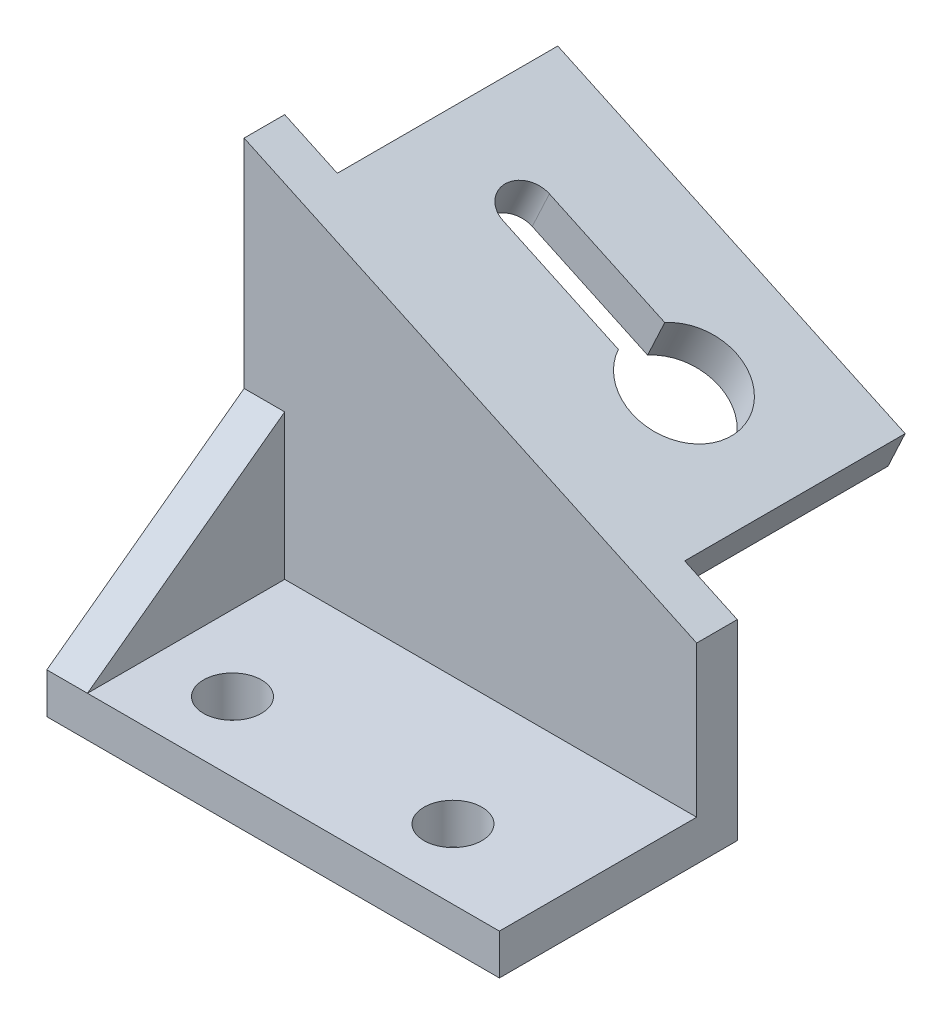
ISO-10303-21;
HEADER;
FILE_DESCRIPTION(('STEP AP214'),'2;1');
FILE_NAME('part.step','',(''),(''),'','','');
FILE_SCHEMA(('AUTOMOTIVE_DESIGN { 1 0 10303 214 1 1 1 1 }'));
ENDSEC;
DATA;
#1=APPLICATION_CONTEXT('core data for automotive mechanical design processes');
#2=APPLICATION_PROTOCOL_DEFINITION('international standard','automotive_design',2000,#1);
#3=PRODUCT_CONTEXT('',#1,'mechanical');
#4=PRODUCT('Part','Part','',(#3));
#5=PRODUCT_RELATED_PRODUCT_CATEGORY('part','',(#4));
#6=PRODUCT_DEFINITION_FORMATION('','',#4);
#7=PRODUCT_DEFINITION_CONTEXT('part definition',#1,'design');
#8=PRODUCT_DEFINITION('design','',#6,#7);
#9=PRODUCT_DEFINITION_SHAPE('','',#8);
#10=(LENGTH_UNIT() NAMED_UNIT(*) SI_UNIT(.MILLI.,.METRE.));
#11=(NAMED_UNIT(*) PLANE_ANGLE_UNIT() SI_UNIT($,.RADIAN.));
#12=(NAMED_UNIT(*) SI_UNIT($,.STERADIAN.) SOLID_ANGLE_UNIT());
#13=UNCERTAINTY_MEASURE_WITH_UNIT(LENGTH_MEASURE(1.E-05),#10,'distance_accuracy_value','');
#14=(GEOMETRIC_REPRESENTATION_CONTEXT(3) GLOBAL_UNCERTAINTY_ASSIGNED_CONTEXT((#13)) GLOBAL_UNIT_ASSIGNED_CONTEXT((#10,
#11,#12)) REPRESENTATION_CONTEXT('',''));
#15=CARTESIAN_POINT('',(0.,0.,0.));
#16=DIRECTION('',(0.,0.,1.));
#17=DIRECTION('',(1.,0.,0.));
#18=AXIS2_PLACEMENT_3D('',#15,#16,#17);
#19=CARTESIAN_POINT('',(78.,33.,-79.));
#20=DIRECTION('',(0.422618261740694,0.906307787036653,0.));
#21=DIRECTION('',(-0.906307787036653,0.422618261740694,0.));
#22=AXIS2_PLACEMENT_3D('',#19,#20,#21);
#23=PLANE('',#22);
#24=DIRECTION('',(0.906307787036652,-0.422618261740694,0.));
#25=VECTOR('',#24,1.);
#26=CARTESIAN_POINT('',(26.5710165336876,56.9817288414679,-41.));
#27=LINE('',#26,#25);
#28=CARTESIAN_POINT('',(68.9369221296335,37.226182617407,-41.));
#29=VERTEX_POINT('',#28);
#30=CARTESIAN_POINT('',(78.,33.,-41.));
#31=VERTEX_POINT('',#30);
#32=EDGE_CURVE('E178',#29,#31,#27,.T.);
#33=ORIENTED_EDGE('',*,*,#32,.F.);
#34=DIRECTION('',(0.,0.,1.));
#35=VECTOR('',#34,1.);
#36=CARTESIAN_POINT('',(68.9369221296335,37.226182617407,0.));
#37=LINE('',#36,#35);
#38=CARTESIAN_POINT('',(68.9369221296335,37.226182617407,-79.));
#39=VERTEX_POINT('',#38);
#40=EDGE_CURVE('E175',#39,#29,#37,.T.);
#41=ORIENTED_EDGE('',*,*,#40,.F.);
#42=DIRECTION('',(-0.906307787036653,0.422618261740694,0.));
#43=VECTOR('',#42,1.);
#44=CARTESIAN_POINT('',(78.,33.,-79.));
#45=LINE('',#44,#43);
#46=CARTESIAN_POINT('',(9.06307787036653,65.1458147186823,-79.));
#47=VERTEX_POINT('',#46);
#48=EDGE_CURVE('E244',#39,#47,#45,.T.);
#49=ORIENTED_EDGE('',*,*,#48,.T.);
#50=DIRECTION('',(0.,0.,1.));
#51=VECTOR('',#50,1.);
#52=CARTESIAN_POINT('',(9.06307787036657,65.1458147186824,0.));
#53=LINE('',#52,#51);
#54=CARTESIAN_POINT('',(9.06307787036656,65.1458147186824,-41.));
#55=VERTEX_POINT('',#54);
#56=EDGE_CURVE('E195',#47,#55,#53,.T.);
#57=ORIENTED_EDGE('',*,*,#56,.T.);
#58=DIRECTION('',(-0.906307787036652,0.422618261740694,0.));
#59=VECTOR('',#58,1.);
#60=CARTESIAN_POINT('',(26.5710165336877,56.9817288414679,-41.));
#61=LINE('',#60,#59);
#62=CARTESIAN_POINT('',(0.,69.3719973360893,-41.));
#63=VERTEX_POINT('',#62);
#64=EDGE_CURVE('E191',#55,#63,#61,.T.);
#65=ORIENTED_EDGE('',*,*,#64,.T.);
#66=DIRECTION('',(0.,0.,1.));
#67=VECTOR('',#66,1.);
#68=CARTESIAN_POINT('',(0.,69.3719973360893,-79.));
#69=LINE('',#68,#67);
#70=CARTESIAN_POINT('',(0.,69.3719973360893,-34.));
#71=VERTEX_POINT('',#70);
#72=EDGE_CURVE('E260',#63,#71,#69,.T.);
#73=ORIENTED_EDGE('',*,*,#72,.T.);
#74=DIRECTION('',(0.906307787036653,-0.422618261740694,0.));
#75=VECTOR('',#74,1.);
#76=CARTESIAN_POINT('',(78.,33.,-34.));
#77=LINE('',#76,#75);
#78=CARTESIAN_POINT('',(78.,33.,-34.));
#79=VERTEX_POINT('',#78);
#80=EDGE_CURVE('E234',#71,#79,#77,.T.);
#81=ORIENTED_EDGE('',*,*,#80,.T.);
#82=DIRECTION('',(0.,0.,1.));
#83=VECTOR('',#82,1.);
#84=CARTESIAN_POINT('',(78.,33.,-79.));
#85=LINE('',#84,#83);
#86=EDGE_CURVE('E264',#31,#79,#85,.T.);
#87=ORIENTED_EDGE('',*,*,#86,.F.);
#88=EDGE_LOOP('',(#33,#41,#49,#57,#65,#73,#81,#87));
#89=FACE_BOUND('',#88,.T.);
#90=CARTESIAN_POINT('',(23.6215327778009,58.3570957044417,-59.));
#91=DIRECTION('',(0.422618261740694,0.906307787036653,0.));
#92=DIRECTION('',(-0.906307787036653,0.422618261740694,0.));
#93=AXIS2_PLACEMENT_3D('',#90,#91,#92);
#94=CIRCLE('',#93,4.00000000000001);
#95=CARTESIAN_POINT('',(23.6215327778008,58.3570957044416,-63.));
#96=VERTEX_POINT('',#95);
#97=CARTESIAN_POINT('',(23.6215327778009,58.3570957044417,-55.));
#98=VERTEX_POINT('',#97);
#99=EDGE_CURVE('E345',#96,#98,#94,.T.);
#100=ORIENTED_EDGE('',*,*,#99,.F.);
#101=DIRECTION('',(0.906307787036652,-0.422618261740694,0.));
#102=VECTOR('',#101,1.);
#103=CARTESIAN_POINT('',(23.6215327778009,58.3570957044417,-63.));
#104=LINE('',#103,#102);
#105=CARTESIAN_POINT('',(43.5038794105209,49.0858052075122,-63.));
#106=VERTEX_POINT('',#105);
#107=EDGE_CURVE('E179',#96,#106,#104,.T.);
#108=ORIENTED_EDGE('',*,*,#107,.T.);
#109=CARTESIAN_POINT('',(50.8107663889004,45.6785478522209,-59.));
#110=DIRECTION('',(0.422618261740694,0.906307787036653,0.));
#111=DIRECTION('',(-0.906307787036653,0.422618261740694,0.));
#112=AXIS2_PLACEMENT_3D('',#109,#110,#111);
#113=CIRCLE('',#112,9.00000000000001);
#114=CARTESIAN_POINT('',(43.5038794105209,49.0858052075122,-55.));
#115=VERTEX_POINT('',#114);
#116=EDGE_CURVE('E185',#115,#106,#113,.T.);
#117=ORIENTED_EDGE('',*,*,#116,.F.);
#118=DIRECTION('',(0.906307787036652,-0.422618261740694,0.));
#119=VECTOR('',#118,1.);
#120=CARTESIAN_POINT('',(23.6215327778009,58.3570957044417,-55.));
#121=LINE('',#120,#119);
#122=EDGE_CURVE('E349',#98,#115,#121,.T.);
#123=ORIENTED_EDGE('',*,*,#122,.F.);
#124=EDGE_LOOP('',(#100,#108,#117,#123));
#125=FACE_BOUND('',#124,.T.);
#126=ADVANCED_FACE('F45',(#89,#125),#23,.T.);
#127=CARTESIAN_POINT('',(0.,0.,-79.));
#128=DIRECTION('',(-1.,0.,0.));
#129=DIRECTION('',(0.,0.,1.));
#130=AXIS2_PLACEMENT_3D('',#127,#128,#129);
#131=PLANE('',#130);
#132=DIRECTION('',(0.,-1.,0.));
#133=VECTOR('',#132,1.);
#134=CARTESIAN_POINT('',(0.,0.,-41.));
#135=LINE('',#134,#133);
#136=CARTESIAN_POINT('',(0.,0.,-41.));
#137=VERTEX_POINT('',#136);
#138=EDGE_CURVE('E54',#63,#137,#135,.T.);
#139=ORIENTED_EDGE('',*,*,#138,.T.);
#140=DIRECTION('',(0.,0.,1.));
#141=VECTOR('',#140,1.);
#142=CARTESIAN_POINT('',(0.,0.,-79.));
#143=LINE('',#142,#141);
#144=CARTESIAN_POINT('',(0.,0.,0.));
#145=VERTEX_POINT('',#144);
#146=EDGE_CURVE('E248',#137,#145,#143,.T.);
#147=ORIENTED_EDGE('',*,*,#146,.T.);
#148=DIRECTION('',(0.,-1.,0.));
#149=VECTOR('',#148,1.);
#150=CARTESIAN_POINT('',(0.,0.,0.));
#151=LINE('',#150,#149);
#152=CARTESIAN_POINT('',(0.,6.99999999999999,0.));
#153=VERTEX_POINT('',#152);
#154=EDGE_CURVE('E243',#153,#145,#151,.T.);
#155=ORIENTED_EDGE('',*,*,#154,.F.);
#156=DIRECTION('',(0.,0.592390450477518,-0.805651012649425));
#157=VECTOR('',#156,1.);
#158=CARTESIAN_POINT('',(0.,4.5435148792813,3.34081976417743));
#159=LINE('',#158,#157);
#160=CARTESIAN_POINT('',(0.,32.,-34.));
#161=VERTEX_POINT('',#160);
#162=EDGE_CURVE('E207',#153,#161,#159,.T.);
#163=ORIENTED_EDGE('',*,*,#162,.T.);
#164=DIRECTION('',(0.,-1.,0.));
#165=VECTOR('',#164,1.);
#166=CARTESIAN_POINT('',(0.,0.,-34.));
#167=LINE('',#166,#165);
#168=EDGE_CURVE('E204',#71,#161,#167,.T.);
#169=ORIENTED_EDGE('',*,*,#168,.F.);
#170=ORIENTED_EDGE('',*,*,#72,.F.);
#171=EDGE_LOOP('',(#139,#147,#155,#163,#169,#170));
#172=FACE_BOUND('',#171,.T.);
#173=ADVANCED_FACE('F47',(#172),#131,.T.);
#174=CARTESIAN_POINT('',(0.,0.,-79.));
#175=DIRECTION('',(0.,-1.,0.));
#176=DIRECTION('',(0.,0.,-1.));
#177=AXIS2_PLACEMENT_3D('',#174,#175,#176);
#178=PLANE('',#177);
#179=CARTESIAN_POINT('',(20.,0.,-12.));
#180=DIRECTION('',(0.,1.,0.));
#181=DIRECTION('',(0.,0.,1.));
#182=AXIS2_PLACEMENT_3D('',#179,#180,#181);
#183=CIRCLE('',#182,5.);
#184=CARTESIAN_POINT('',(20.,0.,-7.));
#185=VERTEX_POINT('',#184);
#186=EDGE_CURVE('E171',#185,#185,#183,.T.);
#187=ORIENTED_EDGE('',*,*,#186,.T.);
#188=EDGE_LOOP('',(#187));
#189=FACE_BOUND('',#188,.T.);
#190=CARTESIAN_POINT('',(58.,0.,-12.));
#191=DIRECTION('',(0.,1.,0.));
#192=DIRECTION('',(0.,0.,1.));
#193=AXIS2_PLACEMENT_3D('',#190,#191,#192);
#194=CIRCLE('',#193,5.);
#195=CARTESIAN_POINT('',(58.,0.,-7.));
#196=VERTEX_POINT('',#195);
#197=EDGE_CURVE('E378',#196,#196,#194,.T.);
#198=ORIENTED_EDGE('',*,*,#197,.T.);
#199=EDGE_LOOP('',(#198));
#200=FACE_BOUND('',#199,.T.);
#201=ORIENTED_EDGE('',*,*,#146,.F.);
#202=DIRECTION('',(-1.,0.,0.));
#203=VECTOR('',#202,1.);
#204=CARTESIAN_POINT('',(0.,0.,-41.));
#205=LINE('',#204,#203);
#206=CARTESIAN_POINT('',(78.,0.,-41.));
#207=VERTEX_POINT('',#206);
#208=EDGE_CURVE('E281',#207,#137,#205,.T.);
#209=ORIENTED_EDGE('',*,*,#208,.F.);
#210=DIRECTION('',(0.,0.,1.));
#211=VECTOR('',#210,1.);
#212=CARTESIAN_POINT('',(78.,0.,-79.));
#213=LINE('',#212,#211);
#214=CARTESIAN_POINT('',(78.,0.,0.));
#215=VERTEX_POINT('',#214);
#216=EDGE_CURVE('E267',#207,#215,#213,.T.);
#217=ORIENTED_EDGE('',*,*,#216,.T.);
#218=DIRECTION('',(1.,0.,0.));
#219=VECTOR('',#218,1.);
#220=CARTESIAN_POINT('',(0.,0.,0.));
#221=LINE('',#220,#219);
#222=EDGE_CURVE('E253',#145,#215,#221,.T.);
#223=ORIENTED_EDGE('',*,*,#222,.F.);
#224=EDGE_LOOP('',(#201,#209,#217,#223));
#225=FACE_BOUND('',#224,.T.);
#226=ADVANCED_FACE('F295',(#189,#200,#225),#178,.T.);
#227=CARTESIAN_POINT('',(0.,0.,-79.));
#228=DIRECTION('',(0.,0.,-1.));
#229=DIRECTION('',(-1.,0.,0.));
#230=AXIS2_PLACEMENT_3D('',#227,#228,#229);
#231=PLANE('',#230);
#232=DIRECTION('',(0.906307787036652,-0.422618261740694,0.));
#233=VECTOR('',#232,1.);
#234=CARTESIAN_POINT('',(-2.95832783218489,63.0278428268328,-79.));
#235=LINE('',#234,#233);
#236=CARTESIAN_POINT('',(6.1047500381817,58.8016602094259,-79.));
#237=VERTEX_POINT('',#236);
#238=CARTESIAN_POINT('',(65.9785942974487,30.8820281081505,-79.));
#239=VERTEX_POINT('',#238);
#240=EDGE_CURVE('E61',#237,#239,#235,.T.);
#241=ORIENTED_EDGE('',*,*,#240,.F.);
#242=DIRECTION('',(0.422618261740694,0.906307787036653,0.));
#243=VECTOR('',#242,1.);
#244=CARTESIAN_POINT('',(-17.5079386633211,8.16408587721448,-79.));
#245=LINE('',#244,#243);
#246=EDGE_CURVE('E275',#237,#47,#245,.T.);
#247=ORIENTED_EDGE('',*,*,#246,.T.);
#248=ORIENTED_EDGE('',*,*,#48,.F.);
#249=DIRECTION('',(0.422618261740694,0.906307787036653,0.));
#250=VECTOR('',#249,1.);
#251=CARTESIAN_POINT('',(42.3659055959459,-19.755546224061,-79.));
#252=LINE('',#251,#250);
#253=EDGE_CURVE('E278',#239,#39,#252,.T.);
#254=ORIENTED_EDGE('',*,*,#253,.F.);
#255=EDGE_LOOP('',(#241,#247,#248,#254));
#256=FACE_BOUND('',#255,.T.);
#257=ADVANCED_FACE('F426',(#256),#231,.T.);
#258=CARTESIAN_POINT('',(78.,0.,-79.));
#259=DIRECTION('',(1.,0.,0.));
#260=DIRECTION('',(0.,0.,-1.));
#261=AXIS2_PLACEMENT_3D('',#258,#259,#260);
#262=PLANE('',#261);
#263=DIRECTION('',(0.,-1.,0.));
#264=VECTOR('',#263,1.);
#265=CARTESIAN_POINT('',(78.,0.,-41.));
#266=LINE('',#265,#264);
#267=EDGE_CURVE('E201',#31,#207,#266,.T.);
#268=ORIENTED_EDGE('',*,*,#267,.F.);
#269=ORIENTED_EDGE('',*,*,#86,.T.);
#270=DIRECTION('',(0.,-1.,0.));
#271=VECTOR('',#270,1.);
#272=CARTESIAN_POINT('',(78.,0.,-34.));
#273=LINE('',#272,#271);
#274=CARTESIAN_POINT('',(78.,7.,-34.));
#275=VERTEX_POINT('',#274);
#276=EDGE_CURVE('E216',#79,#275,#273,.T.);
#277=ORIENTED_EDGE('',*,*,#276,.T.);
#278=DIRECTION('',(0.,0.,-1.));
#279=VECTOR('',#278,1.);
#280=CARTESIAN_POINT('',(78.,7.,0.));
#281=LINE('',#280,#279);
#282=CARTESIAN_POINT('',(78.,6.99999999999999,0.));
#283=VERTEX_POINT('',#282);
#284=EDGE_CURVE('E219',#283,#275,#281,.T.);
#285=ORIENTED_EDGE('',*,*,#284,.F.);
#286=DIRECTION('',(0.,1.,0.));
#287=VECTOR('',#286,1.);
#288=CARTESIAN_POINT('',(78.,0.,0.));
#289=LINE('',#288,#287);
#290=EDGE_CURVE('E249',#215,#283,#289,.T.);
#291=ORIENTED_EDGE('',*,*,#290,.F.);
#292=ORIENTED_EDGE('',*,*,#216,.F.);
#293=EDGE_LOOP('',(#268,#269,#277,#285,#291,#292));
#294=FACE_BOUND('',#293,.T.);
#295=ADVANCED_FACE('F424',(#294),#262,.T.);
#296=CARTESIAN_POINT('',(0.,0.,0.));
#297=DIRECTION('',(0.,0.,-1.));
#298=DIRECTION('',(-1.,0.,0.));
#299=AXIS2_PLACEMENT_3D('',#296,#297,#298);
#300=PLANE('',#299);
#301=DIRECTION('',(1.,0.,0.));
#302=VECTOR('',#301,1.);
#303=CARTESIAN_POINT('',(-71.0370751910094,6.99999999999999,0.));
#304=LINE('',#303,#302);
#305=CARTESIAN_POINT('',(7.00000000000001,6.99999999999999,0.));
#306=VERTEX_POINT('',#305);
#307=EDGE_CURVE('E224',#306,#283,#304,.T.);
#308=ORIENTED_EDGE('',*,*,#307,.F.);
#309=DIRECTION('',(1.,0.,0.));
#310=VECTOR('',#309,1.);
#311=CARTESIAN_POINT('',(0.,6.99999999999999,0.));
#312=LINE('',#311,#310);
#313=EDGE_CURVE('E211',#153,#306,#312,.T.);
#314=ORIENTED_EDGE('',*,*,#313,.F.);
#315=ORIENTED_EDGE('',*,*,#154,.T.);
#316=ORIENTED_EDGE('',*,*,#222,.T.);
#317=ORIENTED_EDGE('',*,*,#290,.T.);
#318=EDGE_LOOP('',(#308,#314,#315,#316,#317));
#319=FACE_BOUND('',#318,.T.);
#320=ADVANCED_FACE('F299',(#319),#300,.F.);
#321=CARTESIAN_POINT('',(-71.0370751910094,0.,-34.));
#322=DIRECTION('',(0.,0.,1.));
#323=DIRECTION('',(0.,-1.,0.));
#324=AXIS2_PLACEMENT_3D('',#321,#322,#323);
#325=PLANE('',#324);
#326=DIRECTION('',(1.,0.,0.));
#327=VECTOR('',#326,1.);
#328=CARTESIAN_POINT('',(-71.0370751910094,7.,-34.));
#329=LINE('',#328,#327);
#330=CARTESIAN_POINT('',(7.00000000000001,7.,-34.));
#331=VERTEX_POINT('',#330);
#332=EDGE_CURVE('E231',#331,#275,#329,.T.);
#333=ORIENTED_EDGE('',*,*,#332,.T.);
#334=ORIENTED_EDGE('',*,*,#276,.F.);
#335=ORIENTED_EDGE('',*,*,#80,.F.);
#336=ORIENTED_EDGE('',*,*,#168,.T.);
#337=DIRECTION('',(1.,0.,0.));
#338=VECTOR('',#337,1.);
#339=CARTESIAN_POINT('',(0.,32.,-34.));
#340=LINE('',#339,#338);
#341=CARTESIAN_POINT('',(7.,32.,-34.));
#342=VERTEX_POINT('',#341);
#343=EDGE_CURVE('E212',#161,#342,#340,.T.);
#344=ORIENTED_EDGE('',*,*,#343,.T.);
#345=DIRECTION('',(0.,-1.,0.));
#346=VECTOR('',#345,1.);
#347=CARTESIAN_POINT('',(7.00000000000001,0.,-34.));
#348=LINE('',#347,#346);
#349=EDGE_CURVE('E223',#342,#331,#348,.T.);
#350=ORIENTED_EDGE('',*,*,#349,.T.);
#351=EDGE_LOOP('',(#333,#334,#335,#336,#344,#350));
#352=FACE_BOUND('',#351,.T.);
#353=ADVANCED_FACE('F306',(#352),#325,.T.);
#354=CARTESIAN_POINT('',(-71.0370751910094,7.,0.));
#355=DIRECTION('',(0.,-1.,0.));
#356=DIRECTION('',(0.,0.,-1.));
#357=AXIS2_PLACEMENT_3D('',#354,#355,#356);
#358=PLANE('',#357);
#359=CARTESIAN_POINT('',(20.,7.,-12.));
#360=DIRECTION('',(0.,1.,0.));
#361=DIRECTION('',(0.,0.,1.));
#362=AXIS2_PLACEMENT_3D('',#359,#360,#361);
#363=CIRCLE('',#362,5.);
#364=CARTESIAN_POINT('',(20.,7.,-7.));
#365=VERTEX_POINT('',#364);
#366=EDGE_CURVE('E386',#365,#365,#363,.T.);
#367=ORIENTED_EDGE('',*,*,#366,.F.);
#368=EDGE_LOOP('',(#367));
#369=FACE_BOUND('',#368,.T.);
#370=CARTESIAN_POINT('',(58.,7.,-12.));
#371=DIRECTION('',(0.,1.,0.));
#372=DIRECTION('',(0.,0.,1.));
#373=AXIS2_PLACEMENT_3D('',#370,#371,#372);
#374=CIRCLE('',#373,5.);
#375=CARTESIAN_POINT('',(58.,7.,-7.));
#376=VERTEX_POINT('',#375);
#377=EDGE_CURVE('E382',#376,#376,#374,.T.);
#378=ORIENTED_EDGE('',*,*,#377,.F.);
#379=EDGE_LOOP('',(#378));
#380=FACE_BOUND('',#379,.T.);
#381=ORIENTED_EDGE('',*,*,#307,.T.);
#382=ORIENTED_EDGE('',*,*,#284,.T.);
#383=ORIENTED_EDGE('',*,*,#332,.F.);
#384=DIRECTION('',(0.,0.,-1.));
#385=VECTOR('',#384,1.);
#386=CARTESIAN_POINT('',(7.00000000000001,7.,0.));
#387=LINE('',#386,#385);
#388=EDGE_CURVE('E227',#306,#331,#387,.T.);
#389=ORIENTED_EDGE('',*,*,#388,.F.);
#390=EDGE_LOOP('',(#381,#382,#383,#389));
#391=FACE_BOUND('',#390,.T.);
#392=ADVANCED_FACE('F313',(#369,#380,#391),#358,.F.);
#393=CARTESIAN_POINT('',(7.,0.,-79.));
#394=DIRECTION('',(-1.,0.,0.));
#395=DIRECTION('',(0.,0.,1.));
#396=AXIS2_PLACEMENT_3D('',#393,#394,#395);
#397=PLANE('',#396);
#398=ORIENTED_EDGE('',*,*,#349,.F.);
#399=DIRECTION('',(0.,-0.592390450477518,0.805651012649425));
#400=VECTOR('',#399,1.);
#401=CARTESIAN_POINT('',(7.,42.2470522178551,-47.935991016283));
#402=LINE('',#401,#400);
#403=EDGE_CURVE('E263',#342,#306,#402,.T.);
#404=ORIENTED_EDGE('',*,*,#403,.T.);
#405=ORIENTED_EDGE('',*,*,#388,.T.);
#406=EDGE_LOOP('',(#398,#404,#405));
#407=FACE_BOUND('',#406,.T.);
#408=ADVANCED_FACE('F309',(#407),#397,.F.);
#409=CARTESIAN_POINT('',(0.,4.5435148792813,3.34081976417743));
#410=DIRECTION('',(0.,-0.805651012649425,-0.592390450477518));
#411=DIRECTION('',(0.,0.592390450477518,-0.805651012649425));
#412=AXIS2_PLACEMENT_3D('',#409,#410,#411);
#413=PLANE('',#412);
#414=ORIENTED_EDGE('',*,*,#343,.F.);
#415=ORIENTED_EDGE('',*,*,#162,.F.);
#416=ORIENTED_EDGE('',*,*,#313,.T.);
#417=ORIENTED_EDGE('',*,*,#403,.F.);
#418=EDGE_LOOP('',(#414,#415,#416,#417));
#419=FACE_BOUND('',#418,.T.);
#420=ADVANCED_FACE('F303',(#419),#413,.F.);
#421=CARTESIAN_POINT('',(-17.5079386633211,8.16408587721445,0.));
#422=DIRECTION('',(-0.906307787036653,0.422618261740694,0.));
#423=DIRECTION('',(-0.422618261740694,-0.906307787036653,0.));
#424=AXIS2_PLACEMENT_3D('',#421,#422,#423);
#425=PLANE('',#424);
#426=DIRECTION('',(0.,0.,-1.));
#427=VECTOR('',#426,1.);
#428=CARTESIAN_POINT('',(6.10475003818171,58.8016602094258,0.));
#429=LINE('',#428,#427);
#430=CARTESIAN_POINT('',(6.10475003818169,58.8016602094258,-41.));
#431=VERTEX_POINT('',#430);
#432=EDGE_CURVE('E325',#431,#237,#429,.T.);
#433=ORIENTED_EDGE('',*,*,#432,.F.);
#434=DIRECTION('',(0.422618261740694,0.906307787036653,0.));
#435=VECTOR('',#434,1.);
#436=CARTESIAN_POINT('',(-17.5079386633211,8.16408587721445,-41.));
#437=LINE('',#436,#435);
#438=EDGE_CURVE('E161',#431,#55,#437,.T.);
#439=ORIENTED_EDGE('',*,*,#438,.T.);
#440=ORIENTED_EDGE('',*,*,#56,.F.);
#441=ORIENTED_EDGE('',*,*,#246,.F.);
#442=EDGE_LOOP('',(#433,#439,#440,#441));
#443=FACE_BOUND('',#442,.T.);
#444=ADVANCED_FACE('F324',(#443),#425,.T.);
#445=CARTESIAN_POINT('',(0.,0.,-41.));
#446=DIRECTION('',(0.,0.,1.));
#447=DIRECTION('',(1.,0.,0.));
#448=AXIS2_PLACEMENT_3D('',#445,#446,#447);
#449=PLANE('',#448);
#450=ORIENTED_EDGE('',*,*,#267,.T.);
#451=ORIENTED_EDGE('',*,*,#208,.T.);
#452=ORIENTED_EDGE('',*,*,#138,.F.);
#453=ORIENTED_EDGE('',*,*,#64,.F.);
#454=ORIENTED_EDGE('',*,*,#438,.F.);
#455=DIRECTION('',(0.906307787036652,-0.422618261740694,0.));
#456=VECTOR('',#455,1.);
#457=CARTESIAN_POINT('',(-2.95832783218491,63.0278428268328,-41.));
#458=LINE('',#457,#456);
#459=CARTESIAN_POINT('',(65.9785942974486,30.8820281081504,-41.));
#460=VERTEX_POINT('',#459);
#461=EDGE_CURVE('E155',#431,#460,#458,.T.);
#462=ORIENTED_EDGE('',*,*,#461,.T.);
#463=DIRECTION('',(0.422618261740694,0.906307787036653,0.));
#464=VECTOR('',#463,1.);
#465=CARTESIAN_POINT('',(42.3659055959458,-19.755546224061,-41.));
#466=LINE('',#465,#464);
#467=EDGE_CURVE('E158',#460,#29,#466,.T.);
#468=ORIENTED_EDGE('',*,*,#467,.T.);
#469=ORIENTED_EDGE('',*,*,#32,.T.);
#470=EDGE_LOOP('',(#450,#451,#452,#453,#454,#462,#468,#469));
#471=FACE_BOUND('',#470,.T.);
#472=ADVANCED_FACE('F156',(#471),#449,.F.);
#473=CARTESIAN_POINT('',(42.3659055959458,-19.755546224061,0.));
#474=DIRECTION('',(-0.906307787036653,0.422618261740694,0.));
#475=DIRECTION('',(-0.422618261740694,-0.906307787036653,0.));
#476=AXIS2_PLACEMENT_3D('',#473,#474,#475);
#477=PLANE('',#476);
#478=ORIENTED_EDGE('',*,*,#467,.F.);
#479=DIRECTION('',(0.,0.,1.));
#480=VECTOR('',#479,1.);
#481=CARTESIAN_POINT('',(65.9785942974486,30.8820281081504,-41.));
#482=LINE('',#481,#480);
#483=EDGE_CURVE('E166',#239,#460,#482,.T.);
#484=ORIENTED_EDGE('',*,*,#483,.F.);
#485=ORIENTED_EDGE('',*,*,#253,.T.);
#486=ORIENTED_EDGE('',*,*,#40,.T.);
#487=EDGE_LOOP('',(#478,#484,#485,#486));
#488=FACE_BOUND('',#487,.T.);
#489=ADVANCED_FACE('F173',(#488),#477,.F.);
#490=CARTESIAN_POINT('',(-2.94948375588678,1.37536686297372,-63.));
#491=DIRECTION('',(0.,0.,1.));
#492=DIRECTION('',(1.,0.,0.));
#493=AXIS2_PLACEMENT_3D('',#490,#491,#492);
#494=PLANE('',#493);
#495=DIRECTION('',(-0.906307787036653,0.422618261740694,0.));
#496=VECTOR('',#495,1.);
#497=CARTESIAN_POINT('',(20.663204945616,52.0129411951851,-63.));
#498=LINE('',#497,#496);
#499=CARTESIAN_POINT('',(40.545551578336,42.7416506982557,-63.));
#500=VERTEX_POINT('',#499);
#501=CARTESIAN_POINT('',(20.663204945616,52.0129411951851,-63.));
#502=VERTEX_POINT('',#501);
#503=EDGE_CURVE('E69',#500,#502,#498,.T.);
#504=ORIENTED_EDGE('',*,*,#503,.F.);
#505=DIRECTION('',(0.422618261740694,0.906307787036653,0.));
#506=VECTOR('',#505,1.);
#507=CARTESIAN_POINT('',(16.9328628768332,-7.89592363395571,-63.));
#508=LINE('',#507,#506);
#509=EDGE_CURVE('E327',#500,#106,#508,.T.);
#510=ORIENTED_EDGE('',*,*,#509,.T.);
#511=ORIENTED_EDGE('',*,*,#107,.F.);
#512=DIRECTION('',(0.422618261740694,0.906307787036653,0.));
#513=VECTOR('',#512,1.);
#514=CARTESIAN_POINT('',(-2.94948375588678,1.37536686297372,-63.));
#515=LINE('',#514,#513);
#516=EDGE_CURVE('E342',#502,#96,#515,.T.);
#517=ORIENTED_EDGE('',*,*,#516,.F.);
#518=EDGE_LOOP('',(#504,#510,#511,#517));
#519=FACE_BOUND('',#518,.T.);
#520=ADVANCED_FACE('F365',(#519),#494,.T.);
#521=CARTESIAN_POINT('',(24.2397498552128,-11.3031809892471,-59.));
#522=DIRECTION('',(0.422618261740694,0.906307787036653,0.));
#523=DIRECTION('',(-0.906307787036653,0.422618261740694,0.));
#524=AXIS2_PLACEMENT_3D('',#521,#522,#523);
#525=CYLINDRICAL_SURFACE('',#524,9.00000000000001);
#526=ORIENTED_EDGE('',*,*,#509,.F.);
#527=CARTESIAN_POINT('',(47.8524385567156,39.3343933429643,-59.));
#528=DIRECTION('',(0.422618261740694,0.906307787036652,0.));
#529=DIRECTION('',(-0.906307787036653,0.422618261740694,0.));
#530=AXIS2_PLACEMENT_3D('',#527,#528,#529);
#531=CIRCLE('',#530,9.00000000000001);
#532=CARTESIAN_POINT('',(40.545551578336,42.7416506982557,-55.));
#533=VERTEX_POINT('',#532);
#534=EDGE_CURVE('E333',#500,#533,#531,.F.);
#535=ORIENTED_EDGE('',*,*,#534,.T.);
#536=DIRECTION('',(0.422618261740694,0.906307787036653,0.));
#537=VECTOR('',#536,1.);
#538=CARTESIAN_POINT('',(16.9328628768332,-7.89592363395571,-55.));
#539=LINE('',#538,#537);
#540=EDGE_CURVE('E331',#533,#115,#539,.T.);
#541=ORIENTED_EDGE('',*,*,#540,.T.);
#542=ORIENTED_EDGE('',*,*,#116,.T.);
#543=EDGE_LOOP('',(#526,#535,#541,#542));
#544=FACE_BOUND('',#543,.T.);
#545=ADVANCED_FACE('F357',(#544),#525,.F.);
#546=CARTESIAN_POINT('',(-2.94948375588678,1.37536686297372,-55.));
#547=DIRECTION('',(0.,0.,1.));
#548=DIRECTION('',(1.,0.,0.));
#549=AXIS2_PLACEMENT_3D('',#546,#547,#548);
#550=PLANE('',#549);
#551=ORIENTED_EDGE('',*,*,#540,.F.);
#552=DIRECTION('',(-0.906307787036653,0.422618261740694,0.));
#553=VECTOR('',#552,1.);
#554=CARTESIAN_POINT('',(20.663204945616,52.0129411951851,-55.));
#555=LINE('',#554,#553);
#556=CARTESIAN_POINT('',(20.663204945616,52.0129411951851,-55.));
#557=VERTEX_POINT('',#556);
#558=EDGE_CURVE('E164',#533,#557,#555,.T.);
#559=ORIENTED_EDGE('',*,*,#558,.T.);
#560=DIRECTION('',(0.422618261740694,0.906307787036653,0.));
#561=VECTOR('',#560,1.);
#562=CARTESIAN_POINT('',(-2.94948375588678,1.37536686297372,-55.));
#563=LINE('',#562,#561);
#564=EDGE_CURVE('E339',#557,#98,#563,.T.);
#565=ORIENTED_EDGE('',*,*,#564,.T.);
#566=ORIENTED_EDGE('',*,*,#122,.T.);
#567=EDGE_LOOP('',(#551,#559,#565,#566));
#568=FACE_BOUND('',#567,.T.);
#569=ADVANCED_FACE('F371',(#568),#550,.F.);
#570=CARTESIAN_POINT('',(-2.94948375588678,1.37536686297372,-59.));
#571=DIRECTION('',(0.422618261740694,0.906307787036653,0.));
#572=DIRECTION('',(-0.906307787036653,0.422618261740694,0.));
#573=AXIS2_PLACEMENT_3D('',#570,#571,#572);
#574=CYLINDRICAL_SURFACE('',#573,4.00000000000001);
#575=ORIENTED_EDGE('',*,*,#564,.F.);
#576=CARTESIAN_POINT('',(20.663204945616,52.0129411951851,-59.));
#577=DIRECTION('',(0.422618261740694,0.906307787036652,0.));
#578=DIRECTION('',(-0.906307787036653,0.422618261740694,0.));
#579=AXIS2_PLACEMENT_3D('',#576,#577,#578);
#580=CIRCLE('',#579,4.00000000000001);
#581=EDGE_CURVE('E12',#557,#502,#580,.F.);
#582=ORIENTED_EDGE('',*,*,#581,.T.);
#583=ORIENTED_EDGE('',*,*,#516,.T.);
#584=ORIENTED_EDGE('',*,*,#99,.T.);
#585=EDGE_LOOP('',(#575,#582,#583,#584));
#586=FACE_BOUND('',#585,.T.);
#587=ADVANCED_FACE('F368',(#586),#574,.F.);
#588=CARTESIAN_POINT('',(-2.95832783218491,63.0278428268328,-41.));
#589=DIRECTION('',(0.422618261740694,0.906307787036652,0.));
#590=DIRECTION('',(-0.906307787036653,0.422618261740694,0.));
#591=AXIS2_PLACEMENT_3D('',#588,#589,#590);
#592=PLANE('',#591);
#593=ORIENTED_EDGE('',*,*,#432,.T.);
#594=ORIENTED_EDGE('',*,*,#240,.T.);
#595=ORIENTED_EDGE('',*,*,#483,.T.);
#596=ORIENTED_EDGE('',*,*,#461,.F.);
#597=EDGE_LOOP('',(#593,#594,#595,#596));
#598=FACE_BOUND('',#597,.T.);
#599=ORIENTED_EDGE('',*,*,#503,.T.);
#600=ORIENTED_EDGE('',*,*,#581,.F.);
#601=ORIENTED_EDGE('',*,*,#558,.F.);
#602=ORIENTED_EDGE('',*,*,#534,.F.);
#603=EDGE_LOOP('',(#599,#600,#601,#602));
#604=FACE_BOUND('',#603,.T.);
#605=ADVANCED_FACE('F167',(#598,#604),#592,.F.);
#606=CARTESIAN_POINT('',(58.,0.,-12.));
#607=DIRECTION('',(0.,1.,0.));
#608=DIRECTION('',(0.,0.,1.));
#609=AXIS2_PLACEMENT_3D('',#606,#607,#608);
#610=CYLINDRICAL_SURFACE('',#609,5.);
#611=ORIENTED_EDGE('',*,*,#197,.F.);
#612=EDGE_LOOP('',(#611));
#613=FACE_BOUND('',#612,.T.);
#614=ORIENTED_EDGE('',*,*,#377,.T.);
#615=EDGE_LOOP('',(#614));
#616=FACE_BOUND('',#615,.T.);
#617=ADVANCED_FACE('F399',(#613,#616),#610,.F.);
#618=CARTESIAN_POINT('',(20.,0.,-12.));
#619=DIRECTION('',(0.,1.,0.));
#620=DIRECTION('',(0.,0.,1.));
#621=AXIS2_PLACEMENT_3D('',#618,#619,#620);
#622=CYLINDRICAL_SURFACE('',#621,5.);
#623=ORIENTED_EDGE('',*,*,#186,.F.);
#624=EDGE_LOOP('',(#623));
#625=FACE_BOUND('',#624,.T.);
#626=ORIENTED_EDGE('',*,*,#366,.T.);
#627=EDGE_LOOP('',(#626));
#628=FACE_BOUND('',#627,.T.);
#629=ADVANCED_FACE('F396',(#625,#628),#622,.F.);
#630=CLOSED_SHELL('',(#126,#173,#226,#257,#295,#320,#353,#392,#408,#420,#444,#472,#489,#520,
#545,#569,#587,#605,#617,#629));
#631=MANIFOLD_SOLID_BREP('B2',#630);
#632=ADVANCED_BREP_SHAPE_REPRESENTATION('',(#18,#631),#14);
#633=SHAPE_DEFINITION_REPRESENTATION(#9,#632);
ENDSEC;
END-ISO-10303-21;
